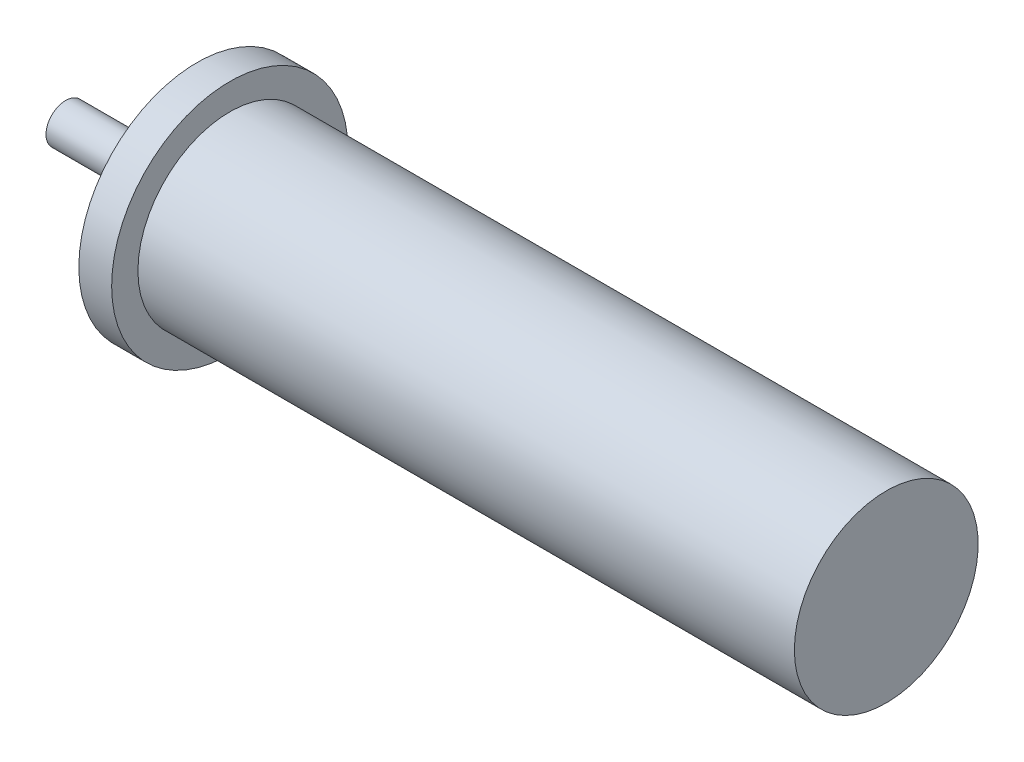
ISO-10303-21;
HEADER;
FILE_DESCRIPTION(('STEP AP214'),'2;1');
FILE_NAME('part.step','',(''),(''),'','','');
FILE_SCHEMA(('AUTOMOTIVE_DESIGN { 1 0 10303 214 1 1 1 1 }'));
ENDSEC;
DATA;
#1=APPLICATION_CONTEXT('core data for automotive mechanical design processes');
#2=APPLICATION_PROTOCOL_DEFINITION('international standard','automotive_design',2000,#1);
#3=PRODUCT_CONTEXT('',#1,'mechanical');
#4=PRODUCT('Part','Part','',(#3));
#5=PRODUCT_RELATED_PRODUCT_CATEGORY('part','',(#4));
#6=PRODUCT_DEFINITION_FORMATION('','',#4);
#7=PRODUCT_DEFINITION_CONTEXT('part definition',#1,'design');
#8=PRODUCT_DEFINITION('design','',#6,#7);
#9=PRODUCT_DEFINITION_SHAPE('','',#8);
#10=(LENGTH_UNIT() NAMED_UNIT(*) SI_UNIT(.MILLI.,.METRE.));
#11=(NAMED_UNIT(*) PLANE_ANGLE_UNIT() SI_UNIT($,.RADIAN.));
#12=(NAMED_UNIT(*) SI_UNIT($,.STERADIAN.) SOLID_ANGLE_UNIT());
#13=UNCERTAINTY_MEASURE_WITH_UNIT(LENGTH_MEASURE(1.E-05),#10,'distance_accuracy_value','');
#14=(GEOMETRIC_REPRESENTATION_CONTEXT(3) GLOBAL_UNCERTAINTY_ASSIGNED_CONTEXT((#13)) GLOBAL_UNIT_ASSIGNED_CONTEXT((#10,
#11,#12)) REPRESENTATION_CONTEXT('',''));
#15=CARTESIAN_POINT('',(0.,0.,0.));
#16=DIRECTION('',(0.,0.,1.));
#17=DIRECTION('',(1.,0.,0.));
#18=AXIS2_PLACEMENT_3D('',#15,#16,#17);
#19=CARTESIAN_POINT('',(0.,0.,0.));
#20=DIRECTION('',(-1.,0.,0.));
#21=DIRECTION('',(0.,0.,1.));
#22=AXIS2_PLACEMENT_3D('',#19,#20,#21);
#23=PLANE('',#22);
#24=CARTESIAN_POINT('',(0.,0.,0.));
#25=DIRECTION('',(-1.,0.,0.));
#26=DIRECTION('',(0.,0.,1.));
#27=AXIS2_PLACEMENT_3D('',#24,#25,#26);
#28=CIRCLE('',#27,3.);
#29=CARTESIAN_POINT('',(0.,0.,3.));
#30=VERTEX_POINT('',#29);
#31=EDGE_CURVE('E66',#30,#30,#28,.T.);
#32=ORIENTED_EDGE('',*,*,#31,.T.);
#33=EDGE_LOOP('',(#32));
#34=FACE_BOUND('',#33,.T.);
#35=ADVANCED_FACE('F38',(#34),#23,.T.);
#36=CARTESIAN_POINT('',(125.,0.,0.));
#37=DIRECTION('',(1.,0.,0.));
#38=DIRECTION('',(0.,0.,-1.));
#39=AXIS2_PLACEMENT_3D('',#36,#37,#38);
#40=PLANE('',#39);
#41=CARTESIAN_POINT('',(125.,0.,0.));
#42=DIRECTION('',(-1.,0.,0.));
#43=DIRECTION('',(0.,0.,1.));
#44=AXIS2_PLACEMENT_3D('',#41,#42,#43);
#45=CIRCLE('',#44,14.);
#46=CARTESIAN_POINT('',(125.,0.,14.));
#47=VERTEX_POINT('',#46);
#48=EDGE_CURVE('E10',#47,#47,#45,.T.);
#49=ORIENTED_EDGE('',*,*,#48,.F.);
#50=EDGE_LOOP('',(#49));
#51=FACE_BOUND('',#50,.T.);
#52=ADVANCED_FACE('F83',(#51),#40,.T.);
#53=CARTESIAN_POINT('',(0.,0.,0.));
#54=DIRECTION('',(-1.,0.,0.));
#55=DIRECTION('',(0.,0.,1.));
#56=AXIS2_PLACEMENT_3D('',#53,#54,#55);
#57=CYLINDRICAL_SURFACE('',#56,14.);
#58=ORIENTED_EDGE('',*,*,#48,.T.);
#59=EDGE_LOOP('',(#58));
#60=FACE_BOUND('',#59,.T.);
#61=CARTESIAN_POINT('',(25.,0.,0.));
#62=DIRECTION('',(-1.,0.,0.));
#63=DIRECTION('',(0.,0.,1.));
#64=AXIS2_PLACEMENT_3D('',#61,#62,#63);
#65=CIRCLE('',#64,14.);
#66=CARTESIAN_POINT('',(25.,0.,14.));
#67=VERTEX_POINT('',#66);
#68=EDGE_CURVE('E44',#67,#67,#65,.T.);
#69=ORIENTED_EDGE('',*,*,#68,.F.);
#70=EDGE_LOOP('',(#69));
#71=FACE_BOUND('',#70,.T.);
#72=ADVANCED_FACE('F87',(#60,#71),#57,.T.);
#73=CARTESIAN_POINT('',(25.,0.,0.));
#74=DIRECTION('',(1.,0.,0.));
#75=DIRECTION('',(0.,0.,-1.));
#76=AXIS2_PLACEMENT_3D('',#73,#74,#75);
#77=PLANE('',#76);
#78=ORIENTED_EDGE('',*,*,#68,.T.);
#79=EDGE_LOOP('',(#78));
#80=FACE_BOUND('',#79,.T.);
#81=CARTESIAN_POINT('',(25.,0.,0.));
#82=DIRECTION('',(-1.,0.,0.));
#83=DIRECTION('',(0.,0.,1.));
#84=AXIS2_PLACEMENT_3D('',#81,#82,#83);
#85=CIRCLE('',#84,18.);
#86=CARTESIAN_POINT('',(25.,0.,18.));
#87=VERTEX_POINT('',#86);
#88=EDGE_CURVE('E48',#87,#87,#85,.T.);
#89=ORIENTED_EDGE('',*,*,#88,.F.);
#90=EDGE_LOOP('',(#89));
#91=FACE_BOUND('',#90,.T.);
#92=ADVANCED_FACE('F92',(#80,#91),#77,.T.);
#93=CARTESIAN_POINT('',(0.,0.,0.));
#94=DIRECTION('',(-1.,0.,0.));
#95=DIRECTION('',(0.,0.,1.));
#96=AXIS2_PLACEMENT_3D('',#93,#94,#95);
#97=CYLINDRICAL_SURFACE('',#96,18.);
#98=ORIENTED_EDGE('',*,*,#88,.T.);
#99=EDGE_LOOP('',(#98));
#100=FACE_BOUND('',#99,.T.);
#101=CARTESIAN_POINT('',(20.,0.,0.));
#102=DIRECTION('',(-1.,0.,0.));
#103=DIRECTION('',(0.,0.,1.));
#104=AXIS2_PLACEMENT_3D('',#101,#102,#103);
#105=CIRCLE('',#104,18.);
#106=CARTESIAN_POINT('',(20.,0.,18.));
#107=VERTEX_POINT('',#106);
#108=EDGE_CURVE('E52',#107,#107,#105,.T.);
#109=ORIENTED_EDGE('',*,*,#108,.F.);
#110=EDGE_LOOP('',(#109));
#111=FACE_BOUND('',#110,.T.);
#112=ADVANCED_FACE('F97',(#100,#111),#97,.T.);
#113=CARTESIAN_POINT('',(20.,0.,0.));
#114=DIRECTION('',(-1.,0.,0.));
#115=DIRECTION('',(0.,0.,1.));
#116=AXIS2_PLACEMENT_3D('',#113,#114,#115);
#117=PLANE('',#116);
#118=ORIENTED_EDGE('',*,*,#108,.T.);
#119=EDGE_LOOP('',(#118));
#120=FACE_BOUND('',#119,.T.);
#121=CARTESIAN_POINT('',(20.,0.,0.));
#122=DIRECTION('',(-1.,0.,0.));
#123=DIRECTION('',(0.,0.,1.));
#124=AXIS2_PLACEMENT_3D('',#121,#122,#123);
#125=CIRCLE('',#124,11.);
#126=CARTESIAN_POINT('',(20.,0.,11.));
#127=VERTEX_POINT('',#126);
#128=EDGE_CURVE('E57',#127,#127,#125,.T.);
#129=ORIENTED_EDGE('',*,*,#128,.F.);
#130=EDGE_LOOP('',(#129));
#131=FACE_BOUND('',#130,.T.);
#132=ADVANCED_FACE('F100',(#120,#131),#117,.T.);
#133=CARTESIAN_POINT('',(0.,0.,0.));
#134=DIRECTION('',(-1.,0.,0.));
#135=DIRECTION('',(0.,0.,1.));
#136=AXIS2_PLACEMENT_3D('',#133,#134,#135);
#137=CYLINDRICAL_SURFACE('',#136,11.);
#138=ORIENTED_EDGE('',*,*,#128,.T.);
#139=EDGE_LOOP('',(#138));
#140=FACE_BOUND('',#139,.T.);
#141=CARTESIAN_POINT('',(18.,0.,0.));
#142=DIRECTION('',(-1.,0.,0.));
#143=DIRECTION('',(0.,0.,1.));
#144=AXIS2_PLACEMENT_3D('',#141,#142,#143);
#145=CIRCLE('',#144,11.);
#146=CARTESIAN_POINT('',(18.,0.,11.));
#147=VERTEX_POINT('',#146);
#148=EDGE_CURVE('E60',#147,#147,#145,.T.);
#149=ORIENTED_EDGE('',*,*,#148,.F.);
#150=EDGE_LOOP('',(#149));
#151=FACE_BOUND('',#150,.T.);
#152=ADVANCED_FACE('F79',(#140,#151),#137,.T.);
#153=CARTESIAN_POINT('',(18.,0.,0.));
#154=DIRECTION('',(-1.,0.,0.));
#155=DIRECTION('',(0.,0.,1.));
#156=AXIS2_PLACEMENT_3D('',#153,#154,#155);
#157=PLANE('',#156);
#158=ORIENTED_EDGE('',*,*,#148,.T.);
#159=EDGE_LOOP('',(#158));
#160=FACE_BOUND('',#159,.T.);
#161=CARTESIAN_POINT('',(18.,0.,0.));
#162=DIRECTION('',(-1.,0.,0.));
#163=DIRECTION('',(0.,0.,1.));
#164=AXIS2_PLACEMENT_3D('',#161,#162,#163);
#165=CIRCLE('',#164,3.);
#166=CARTESIAN_POINT('',(18.,0.,3.));
#167=VERTEX_POINT('',#166);
#168=EDGE_CURVE('E63',#167,#167,#165,.T.);
#169=ORIENTED_EDGE('',*,*,#168,.F.);
#170=EDGE_LOOP('',(#169));
#171=FACE_BOUND('',#170,.T.);
#172=ADVANCED_FACE('F73',(#160,#171),#157,.T.);
#173=CARTESIAN_POINT('',(0.,0.,0.));
#174=DIRECTION('',(-1.,0.,0.));
#175=DIRECTION('',(0.,0.,1.));
#176=AXIS2_PLACEMENT_3D('',#173,#174,#175);
#177=CYLINDRICAL_SURFACE('',#176,3.);
#178=ORIENTED_EDGE('',*,*,#168,.T.);
#179=EDGE_LOOP('',(#178));
#180=FACE_BOUND('',#179,.T.);
#181=ORIENTED_EDGE('',*,*,#31,.F.);
#182=EDGE_LOOP('',(#181));
#183=FACE_BOUND('',#182,.T.);
#184=ADVANCED_FACE('F71',(#180,#183),#177,.T.);
#185=CLOSED_SHELL('',(#35,#52,#72,#92,#112,#132,#152,#172,#184));
#186=MANIFOLD_SOLID_BREP('B2',#185);
#187=ADVANCED_BREP_SHAPE_REPRESENTATION('',(#18,#186),#14);
#188=SHAPE_DEFINITION_REPRESENTATION(#9,#187);
ENDSEC;
END-ISO-10303-21;
